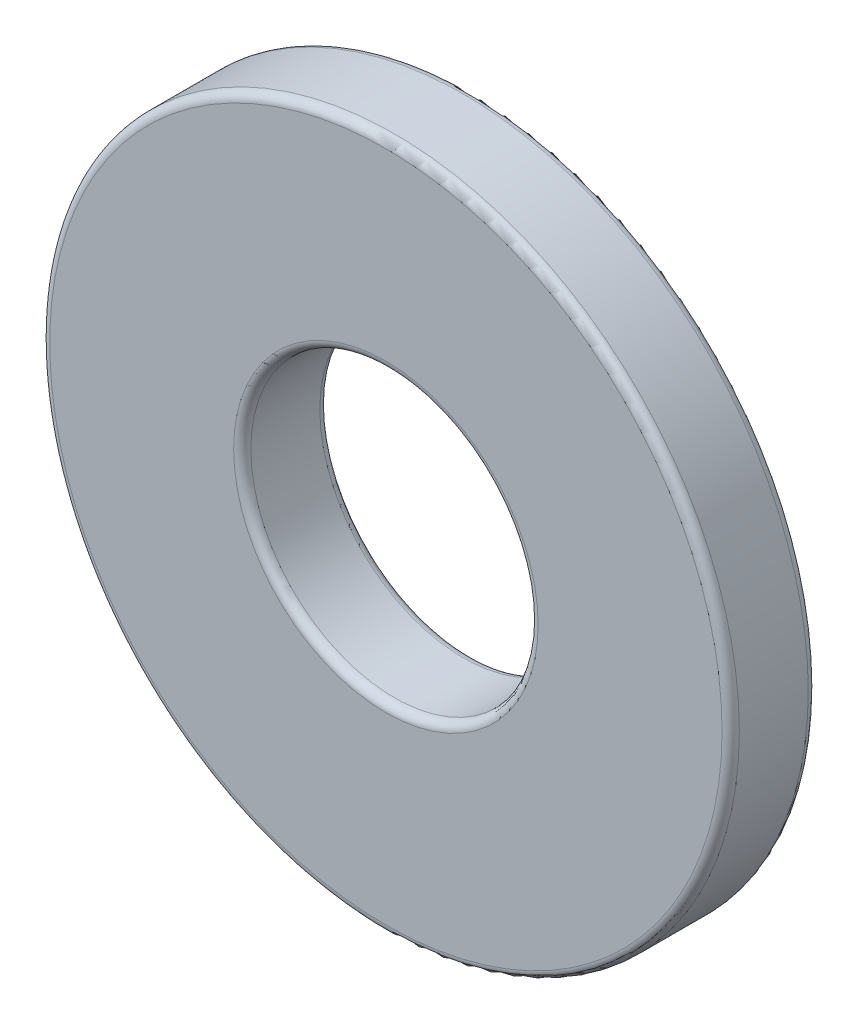
ISO-10303-21;
HEADER;
FILE_DESCRIPTION(('STEP AP214'),'2;1');
FILE_NAME('part.step','',(''),(''),'','','');
FILE_SCHEMA(('AUTOMOTIVE_DESIGN { 1 0 10303 214 1 1 1 1 }'));
ENDSEC;
DATA;
#1=APPLICATION_CONTEXT('core data for automotive mechanical design processes');
#2=APPLICATION_PROTOCOL_DEFINITION('international standard','automotive_design',2000,#1);
#3=PRODUCT_CONTEXT('',#1,'mechanical');
#4=PRODUCT('Part','Part','',(#3));
#5=PRODUCT_RELATED_PRODUCT_CATEGORY('part','',(#4));
#6=PRODUCT_DEFINITION_FORMATION('','',#4);
#7=PRODUCT_DEFINITION_CONTEXT('part definition',#1,'design');
#8=PRODUCT_DEFINITION('design','',#6,#7);
#9=PRODUCT_DEFINITION_SHAPE('','',#8);
#10=(LENGTH_UNIT() NAMED_UNIT(*) SI_UNIT(.MILLI.,.METRE.));
#11=(NAMED_UNIT(*) PLANE_ANGLE_UNIT() SI_UNIT($,.RADIAN.));
#12=(NAMED_UNIT(*) SI_UNIT($,.STERADIAN.) SOLID_ANGLE_UNIT());
#13=UNCERTAINTY_MEASURE_WITH_UNIT(LENGTH_MEASURE(1.E-05),#10,'distance_accuracy_value','');
#14=(GEOMETRIC_REPRESENTATION_CONTEXT(3) GLOBAL_UNCERTAINTY_ASSIGNED_CONTEXT((#13)) GLOBAL_UNIT_ASSIGNED_CONTEXT((#10,
#11,#12)) REPRESENTATION_CONTEXT('',''));
#15=CARTESIAN_POINT('',(0.,0.,0.));
#16=DIRECTION('',(0.,0.,1.));
#17=DIRECTION('',(1.,0.,0.));
#18=AXIS2_PLACEMENT_3D('',#15,#16,#17);
#19=CARTESIAN_POINT('',(0.,0.,1.5));
#20=DIRECTION('',(0.,0.,1.));
#21=DIRECTION('',(1.,0.,0.));
#22=AXIS2_PLACEMENT_3D('',#19,#20,#21);
#23=PLANE('',#22);
#24=CARTESIAN_POINT('',(0.,0.,1.5));
#25=DIRECTION('',(0.,0.,1.));
#26=DIRECTION('',(1.,0.,0.));
#27=AXIS2_PLACEMENT_3D('',#24,#25,#26);
#28=CIRCLE('',#27,2.65);
#29=CARTESIAN_POINT('',(2.65,0.,1.5));
#30=VERTEX_POINT('',#29);
#31=EDGE_CURVE('E10',#30,#30,#28,.F.);
#32=ORIENTED_EDGE('',*,*,#31,.T.);
#33=EDGE_LOOP('',(#32));
#34=FACE_BOUND('',#33,.T.);
#35=CARTESIAN_POINT('',(0.,0.,1.5));
#36=DIRECTION('',(0.,0.,1.));
#37=DIRECTION('',(1.,0.,0.));
#38=AXIS2_PLACEMENT_3D('',#35,#36,#37);
#39=CIRCLE('',#38,5.85);
#40=CARTESIAN_POINT('',(5.85,0.,1.5));
#41=VERTEX_POINT('',#40);
#42=EDGE_CURVE('E37',#41,#41,#39,.T.);
#43=ORIENTED_EDGE('',*,*,#42,.T.);
#44=EDGE_LOOP('',(#43));
#45=FACE_BOUND('',#44,.T.);
#46=ADVANCED_FACE('F30',(#34,#45),#23,.T.);
#47=CARTESIAN_POINT('',(0.,0.,0.));
#48=DIRECTION('',(0.,0.,1.));
#49=DIRECTION('',(1.,0.,0.));
#50=AXIS2_PLACEMENT_3D('',#47,#48,#49);
#51=PLANE('',#50);
#52=CARTESIAN_POINT('',(0.,0.,0.));
#53=DIRECTION('',(0.,0.,1.));
#54=DIRECTION('',(1.,0.,0.));
#55=AXIS2_PLACEMENT_3D('',#52,#53,#54);
#56=CIRCLE('',#55,2.65);
#57=CARTESIAN_POINT('',(2.65,0.,0.));
#58=VERTEX_POINT('',#57);
#59=EDGE_CURVE('E56',#58,#58,#56,.T.);
#60=ORIENTED_EDGE('',*,*,#59,.T.);
#61=EDGE_LOOP('',(#60));
#62=FACE_BOUND('',#61,.T.);
#63=CARTESIAN_POINT('',(0.,0.,0.));
#64=DIRECTION('',(0.,0.,1.));
#65=DIRECTION('',(1.,0.,0.));
#66=AXIS2_PLACEMENT_3D('',#63,#64,#65);
#67=CIRCLE('',#66,5.85);
#68=CARTESIAN_POINT('',(5.85,0.,0.));
#69=VERTEX_POINT('',#68);
#70=EDGE_CURVE('E59',#69,#69,#67,.F.);
#71=ORIENTED_EDGE('',*,*,#70,.T.);
#72=EDGE_LOOP('',(#71));
#73=FACE_BOUND('',#72,.T.);
#74=ADVANCED_FACE('F63',(#62,#73),#51,.F.);
#75=CARTESIAN_POINT('',(0.,0.,1.5));
#76=DIRECTION('',(0.,0.,-1.));
#77=DIRECTION('',(-1.,0.,0.));
#78=AXIS2_PLACEMENT_3D('',#75,#76,#77);
#79=CYLINDRICAL_SURFACE('',#78,6.);
#80=CARTESIAN_POINT('',(0.,0.,0.15));
#81=DIRECTION('',(0.,0.,1.));
#82=DIRECTION('',(1.,0.,0.));
#83=AXIS2_PLACEMENT_3D('',#80,#81,#82);
#84=CIRCLE('',#83,6.);
#85=CARTESIAN_POINT('',(6.,0.,0.15));
#86=VERTEX_POINT('',#85);
#87=EDGE_CURVE('E41',#86,#86,#84,.T.);
#88=ORIENTED_EDGE('',*,*,#87,.T.);
#89=EDGE_LOOP('',(#88));
#90=FACE_BOUND('',#89,.T.);
#91=CARTESIAN_POINT('',(0.,0.,1.35));
#92=DIRECTION('',(0.,0.,1.));
#93=DIRECTION('',(1.,0.,0.));
#94=AXIS2_PLACEMENT_3D('',#91,#92,#93);
#95=CIRCLE('',#94,6.);
#96=CARTESIAN_POINT('',(6.,0.,1.35));
#97=VERTEX_POINT('',#96);
#98=EDGE_CURVE('E45',#97,#97,#95,.F.);
#99=ORIENTED_EDGE('',*,*,#98,.T.);
#100=EDGE_LOOP('',(#99));
#101=FACE_BOUND('',#100,.T.);
#102=ADVANCED_FACE('F73',(#90,#101),#79,.T.);
#103=CARTESIAN_POINT('',(0.,0.,1.5));
#104=DIRECTION('',(0.,0.,-1.));
#105=DIRECTION('',(-1.,0.,0.));
#106=AXIS2_PLACEMENT_3D('',#103,#104,#105);
#107=CYLINDRICAL_SURFACE('',#106,2.5);
#108=CARTESIAN_POINT('',(0.,0.,0.15));
#109=DIRECTION('',(0.,0.,1.));
#110=DIRECTION('',(1.,0.,0.));
#111=AXIS2_PLACEMENT_3D('',#108,#109,#110);
#112=CIRCLE('',#111,2.5);
#113=CARTESIAN_POINT('',(2.5,0.,0.15));
#114=VERTEX_POINT('',#113);
#115=EDGE_CURVE('E50',#114,#114,#112,.F.);
#116=ORIENTED_EDGE('',*,*,#115,.T.);
#117=EDGE_LOOP('',(#116));
#118=FACE_BOUND('',#117,.T.);
#119=CARTESIAN_POINT('',(0.,0.,1.35));
#120=DIRECTION('',(0.,0.,1.));
#121=DIRECTION('',(1.,0.,0.));
#122=AXIS2_PLACEMENT_3D('',#119,#120,#121);
#123=CIRCLE('',#122,2.5);
#124=CARTESIAN_POINT('',(2.5,0.,1.35));
#125=VERTEX_POINT('',#124);
#126=EDGE_CURVE('E53',#125,#125,#123,.T.);
#127=ORIENTED_EDGE('',*,*,#126,.T.);
#128=EDGE_LOOP('',(#127));
#129=FACE_BOUND('',#128,.T.);
#130=ADVANCED_FACE('F76',(#118,#129),#107,.F.);
#131=CARTESIAN_POINT('',(0.,0.,0.15));
#132=DIRECTION('',(0.,0.,1.));
#133=DIRECTION('',(1.,0.,0.));
#134=AXIS2_PLACEMENT_3D('',#131,#132,#133);
#135=TOROIDAL_SURFACE('',#134,2.65,0.15);
#136=ORIENTED_EDGE('',*,*,#115,.F.);
#137=EDGE_LOOP('',(#136));
#138=FACE_BOUND('',#137,.T.);
#139=ORIENTED_EDGE('',*,*,#59,.F.);
#140=EDGE_LOOP('',(#139));
#141=FACE_BOUND('',#140,.T.);
#142=ADVANCED_FACE('F69',(#138,#141),#135,.T.);
#143=CARTESIAN_POINT('',(0.,0.,0.15));
#144=DIRECTION('',(0.,0.,1.));
#145=DIRECTION('',(1.,0.,0.));
#146=AXIS2_PLACEMENT_3D('',#143,#144,#145);
#147=TOROIDAL_SURFACE('',#146,5.85,0.15);
#148=ORIENTED_EDGE('',*,*,#70,.F.);
#149=EDGE_LOOP('',(#148));
#150=FACE_BOUND('',#149,.T.);
#151=ORIENTED_EDGE('',*,*,#87,.F.);
#152=EDGE_LOOP('',(#151));
#153=FACE_BOUND('',#152,.T.);
#154=ADVANCED_FACE('F65',(#150,#153),#147,.T.);
#155=CARTESIAN_POINT('',(0.,0.,1.35));
#156=DIRECTION('',(0.,0.,1.));
#157=DIRECTION('',(1.,0.,0.));
#158=AXIS2_PLACEMENT_3D('',#155,#156,#157);
#159=TOROIDAL_SURFACE('',#158,2.65,0.15);
#160=ORIENTED_EDGE('',*,*,#31,.F.);
#161=EDGE_LOOP('',(#160));
#162=FACE_BOUND('',#161,.T.);
#163=ORIENTED_EDGE('',*,*,#126,.F.);
#164=EDGE_LOOP('',(#163));
#165=FACE_BOUND('',#164,.T.);
#166=ADVANCED_FACE('F68',(#162,#165),#159,.T.);
#167=CARTESIAN_POINT('',(0.,0.,1.35));
#168=DIRECTION('',(0.,0.,1.));
#169=DIRECTION('',(1.,0.,0.));
#170=AXIS2_PLACEMENT_3D('',#167,#168,#169);
#171=TOROIDAL_SURFACE('',#170,5.85,0.15);
#172=ORIENTED_EDGE('',*,*,#98,.F.);
#173=EDGE_LOOP('',(#172));
#174=FACE_BOUND('',#173,.T.);
#175=ORIENTED_EDGE('',*,*,#42,.F.);
#176=EDGE_LOOP('',(#175));
#177=FACE_BOUND('',#176,.T.);
#178=ADVANCED_FACE('F32',(#174,#177),#171,.T.);
#179=CLOSED_SHELL('',(#46,#74,#102,#130,#142,#154,#166,#178));
#180=MANIFOLD_SOLID_BREP('B2',#179);
#181=ADVANCED_BREP_SHAPE_REPRESENTATION('',(#18,#180),#14);
#182=SHAPE_DEFINITION_REPRESENTATION(#9,#181);
ENDSEC;
END-ISO-10303-21;
